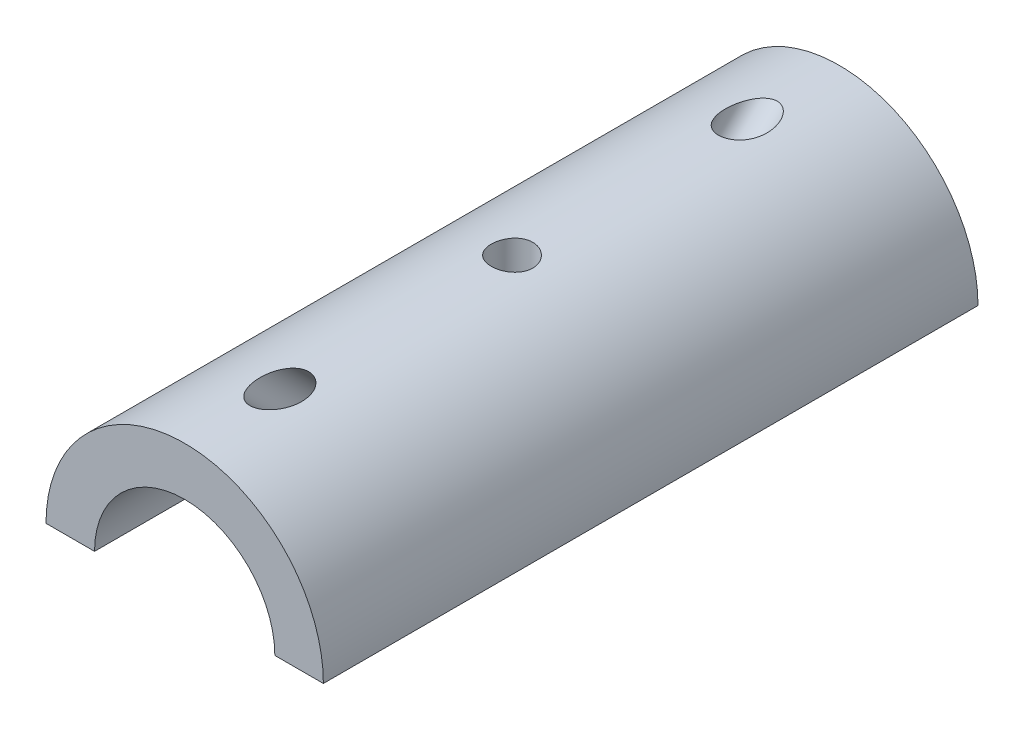
ISO-10303-21;
HEADER;
FILE_DESCRIPTION(('STEP AP214'),'2;1');
FILE_NAME('part.step','',(''),(''),'','','');
FILE_SCHEMA(('AUTOMOTIVE_DESIGN { 1 0 10303 214 1 1 1 1 }'));
ENDSEC;
DATA;
#1=APPLICATION_CONTEXT('core data for automotive mechanical design processes');
#2=APPLICATION_PROTOCOL_DEFINITION('international standard','automotive_design',2000,#1);
#3=PRODUCT_CONTEXT('',#1,'mechanical');
#4=PRODUCT('Part','Part','',(#3));
#5=PRODUCT_RELATED_PRODUCT_CATEGORY('part','',(#4));
#6=PRODUCT_DEFINITION_FORMATION('','',#4);
#7=PRODUCT_DEFINITION_CONTEXT('part definition',#1,'design');
#8=PRODUCT_DEFINITION('design','',#6,#7);
#9=PRODUCT_DEFINITION_SHAPE('','',#8);
#10=(LENGTH_UNIT() NAMED_UNIT(*) SI_UNIT(.MILLI.,.METRE.));
#11=(NAMED_UNIT(*) PLANE_ANGLE_UNIT() SI_UNIT($,.RADIAN.));
#12=(NAMED_UNIT(*) SI_UNIT($,.STERADIAN.) SOLID_ANGLE_UNIT());
#13=UNCERTAINTY_MEASURE_WITH_UNIT(LENGTH_MEASURE(1.E-05),#10,'distance_accuracy_value','');
#14=(GEOMETRIC_REPRESENTATION_CONTEXT(3) GLOBAL_UNCERTAINTY_ASSIGNED_CONTEXT((#13)) GLOBAL_UNIT_ASSIGNED_CONTEXT((#10,
#11,#12)) REPRESENTATION_CONTEXT('',''));
#15=CARTESIAN_POINT('',(0.,0.,0.));
#16=DIRECTION('',(0.,0.,1.));
#17=DIRECTION('',(1.,0.,0.));
#18=AXIS2_PLACEMENT_3D('',#15,#16,#17);
#19=CARTESIAN_POINT('',(0.,0.,47.2));
#20=DIRECTION('',(0.,-1.,0.));
#21=DIRECTION('',(0.,0.,-1.));
#22=AXIS2_PLACEMENT_3D('',#19,#20,#21);
#23=PLANE('',#22);
#24=DIRECTION('',(-1.,0.,0.));
#25=VECTOR('',#24,1.);
#26=CARTESIAN_POINT('',(0.,0.,0.));
#27=LINE('',#26,#25);
#28=CARTESIAN_POINT('',(10.,0.,0.));
#29=VERTEX_POINT('',#28);
#30=CARTESIAN_POINT('',(6.5,0.,0.));
#31=VERTEX_POINT('',#30);
#32=EDGE_CURVE('E118',#29,#31,#27,.T.);
#33=ORIENTED_EDGE('',*,*,#32,.F.);
#34=DIRECTION('',(0.,0.,-1.));
#35=VECTOR('',#34,1.);
#36=CARTESIAN_POINT('',(10.,0.,47.2));
#37=LINE('',#36,#35);
#38=CARTESIAN_POINT('',(10.,0.,47.2));
#39=VERTEX_POINT('',#38);
#40=EDGE_CURVE('E11',#39,#29,#37,.T.);
#41=ORIENTED_EDGE('',*,*,#40,.F.);
#42=DIRECTION('',(-1.,0.,0.));
#43=VECTOR('',#42,1.);
#44=CARTESIAN_POINT('',(0.,0.,47.2));
#45=LINE('',#44,#43);
#46=CARTESIAN_POINT('',(6.5,0.,47.2));
#47=VERTEX_POINT('',#46);
#48=EDGE_CURVE('E98',#39,#47,#45,.T.);
#49=ORIENTED_EDGE('',*,*,#48,.T.);
#50=DIRECTION('',(0.,0.,-1.));
#51=VECTOR('',#50,1.);
#52=CARTESIAN_POINT('',(6.5,0.,47.2));
#53=LINE('',#52,#51);
#54=EDGE_CURVE('E66',#47,#31,#53,.T.);
#55=ORIENTED_EDGE('',*,*,#54,.T.);
#56=EDGE_LOOP('',(#33,#41,#49,#55));
#57=FACE_BOUND('',#56,.T.);
#58=ADVANCED_FACE('F41',(#57),#23,.T.);
#59=CARTESIAN_POINT('',(0.,0.,47.2));
#60=DIRECTION('',(0.,0.,-1.));
#61=DIRECTION('',(-1.,0.,0.));
#62=AXIS2_PLACEMENT_3D('',#59,#60,#61);
#63=CYLINDRICAL_SURFACE('',#62,10.);
#64=CARTESIAN_POINT('',(0.,10.,42.4996946357559));
#65=CARTESIAN_POINT('',(-0.0635989039507117,9.99999967717665,42.4996920436786));
#66=CARTESIAN_POINT('',(-0.127207495527334,9.99938477696123,42.4933020978088));
#67=CARTESIAN_POINT('',(-0.252007458588342,9.99701980142714,42.4684603479657));
#68=CARTESIAN_POINT('',(-0.313196086451994,9.99526847474061,42.4499952473477));
#69=CARTESIAN_POINT('',(-0.430806163939055,9.99088825287487,42.4030100218463));
#70=CARTESIAN_POINT('',(-0.487266234041384,9.98826756493223,42.374583798965));
#71=CARTESIAN_POINT('',(-0.595237629720511,9.98241558292534,42.3096611437978));
#72=CARTESIAN_POINT('',(-0.646746610227039,9.97918400164195,42.2731609140375));
#73=CARTESIAN_POINT('',(-0.770499010242281,9.97055535595661,42.1729182957497));
#74=CARTESIAN_POINT('',(-0.839313474722213,9.96491645458896,42.1049733932648));
#75=CARTESIAN_POINT('',(-0.965496048515054,9.95348364680486,41.959175939002));
#76=CARTESIAN_POINT('',(-1.02283229707522,9.94768935820751,41.8812967656045));
#77=CARTESIAN_POINT('',(-1.15199733435805,9.93372864585401,41.6796816588842));
#78=CARTESIAN_POINT('',(-1.21753240423799,9.92576173913326,41.5519062977958));
#79=CARTESIAN_POINT('',(-1.32782410384219,9.91160603369674,41.2877212459632));
#80=CARTESIAN_POINT('',(-1.37255772370532,9.90541920691462,41.1513021824109));
#81=CARTESIAN_POINT('',(-1.44357544218058,9.89532308685377,40.8686561461704));
#82=CARTESIAN_POINT('',(-1.46916883519212,9.89149985201737,40.7222531561985));
#83=CARTESIAN_POINT('',(-1.49921962458894,9.88699023062867,40.4272655043152));
#84=CARTESIAN_POINT('',(-1.50368292825773,9.88630296736299,40.2786814638078));
#85=CARTESIAN_POINT('',(-1.49060258702766,9.88828311342261,39.9907793502726));
#86=CARTESIAN_POINT('',(-1.47427470408232,9.89076521719285,39.851407442868));
#87=CARTESIAN_POINT('',(-1.41972643907828,9.89874607955285,39.5770354281822));
#88=CARTESIAN_POINT('',(-1.38153161864219,9.90424131558859,39.4420304105095));
#89=CARTESIAN_POINT('',(-1.29385509243652,9.91601351844647,39.2150267529442));
#90=CARTESIAN_POINT('',(-1.2498092575258,9.92172517779647,39.1209030289109));
#91=CARTESIAN_POINT('',(-1.14740716072742,9.9340889184074,38.940834881494));
#92=CARTESIAN_POINT('',(-1.08907228720268,9.94073958787805,38.8548784973973));
#93=CARTESIAN_POINT('',(-0.970931599625774,9.95289179621303,38.711117856903));
#94=CARTESIAN_POINT('',(-0.9137880709378,9.95835501430033,38.6511302854125));
#95=CARTESIAN_POINT('',(-0.790389337606926,9.96890720020389,38.5412392474596));
#96=CARTESIAN_POINT('',(-0.724136500829058,9.97399626475138,38.4913331687206));
#97=CARTESIAN_POINT('',(-0.582960054864975,9.98324549658277,38.4038880140378));
#98=CARTESIAN_POINT('',(-0.507966051527604,9.98739720090838,38.366460261069));
#99=CARTESIAN_POINT('',(-0.351975767201302,9.99410675080151,38.3071889445178));
#100=CARTESIAN_POINT('',(-0.270985934476734,9.99666628160269,38.2853288997554));
#101=CARTESIAN_POINT('',(-0.118279769480278,9.99954866204971,38.2608269253991));
#102=CARTESIAN_POINT('',(-0.0469388411341331,10.0001438139348,38.2558424847074));
#103=CARTESIAN_POINT('',(0.0954617096316786,9.99979732443499,38.2587615395053));
#104=CARTESIAN_POINT('',(0.166521430037876,9.9988562763807,38.2666600591741));
#105=CARTESIAN_POINT('',(0.301456033877372,9.99566838467276,38.2939049543758));
#106=CARTESIAN_POINT('',(0.365495624636665,9.99351179390227,38.3124616173008));
#107=CARTESIAN_POINT('',(0.489784997869023,9.98819221398742,38.3594211533192));
#108=CARTESIAN_POINT('',(0.550034520494336,9.98502915592935,38.3878247006495));
#109=CARTESIAN_POINT('',(0.669030832286039,9.97778357657979,38.4551675462197));
#110=CARTESIAN_POINT('',(0.727475843243674,9.97365760373392,38.4946323954063));
#111=CARTESIAN_POINT('',(0.838009225096328,9.96497967436804,38.5815666770061));
#112=CARTESIAN_POINT('',(0.89009381008862,9.9604274669617,38.6290408371361));
#113=CARTESIAN_POINT('',(1.00822635626238,9.94928933361608,38.7519779747455));
#114=CARTESIAN_POINT('',(1.07081899692213,9.94266022869653,38.8307685224333));
#115=CARTESIAN_POINT('',(1.18236539474259,9.93001347446127,38.9975253472184));
#116=CARTESIAN_POINT('',(1.23129208447275,9.92399705341576,39.0855093665764));
#117=CARTESIAN_POINT('',(1.32984828177012,9.91134442375902,39.2969513816903));
#118=CARTESIAN_POINT('',(1.3746135079915,9.90513431774416,39.4226972892509));
#119=CARTESIAN_POINT('',(1.4435057425282,9.89532536975061,39.6797230678707));
#120=CARTESIAN_POINT('',(1.46760955518643,9.89172946330418,39.8110089854885));
#121=CARTESIAN_POINT('',(1.50080011693299,9.88675820817184,40.1091810011406));
#122=CARTESIAN_POINT('',(1.50454467065039,9.88617483354984,40.2766704448712));
#123=CARTESIAN_POINT('',(1.48493696415328,9.8891380467704,40.6103548616385));
#124=CARTESIAN_POINT('',(1.46152553451969,9.89269365298368,40.7765462107344));
#125=CARTESIAN_POINT('',(1.40628414046452,9.90064041231092,41.0217961692904));
#126=CARTESIAN_POINT('',(1.38437037497752,9.90374501496003,41.1032334726695));
#127=CARTESIAN_POINT('',(1.33357972402698,9.91071302126601,41.2639393289823));
#128=CARTESIAN_POINT('',(1.30470039535891,9.9145766910809,41.3432071100589));
#129=CARTESIAN_POINT('',(1.23981649188422,9.92289879919785,41.498430522161));
#130=CARTESIAN_POINT('',(1.20383701670787,9.92735512481535,41.5743967021809));
#131=CARTESIAN_POINT('',(1.12427948477594,9.93667954991719,41.7221569361075));
#132=CARTESIAN_POINT('',(1.08070938527133,9.9415472154692,41.7939552551308));
#133=CARTESIAN_POINT('',(0.985569274170785,9.95142874377942,41.9316407287742));
#134=CARTESIAN_POINT('',(0.93403420082034,9.95644189387798,41.9975518049831));
#135=CARTESIAN_POINT('',(0.822243321804886,9.96629610262295,42.121553733393));
#136=CARTESIAN_POINT('',(0.761998823108576,9.97113737441191,42.1796545393427));
#137=CARTESIAN_POINT('',(0.644961283169267,9.97931683283171,42.2747241406807));
#138=CARTESIAN_POINT('',(0.589745308913335,9.98276479803552,42.3136072726062));
#139=CARTESIAN_POINT('',(0.473698720935207,9.98894236054643,42.381985177131));
#140=CARTESIAN_POINT('',(0.412874579943458,9.99167277234696,42.4114906023854));
#141=CARTESIAN_POINT('',(0.293970626232979,9.99583392576527,42.4559737007573));
#142=CARTESIAN_POINT('',(0.236380218018727,9.9973780557563,42.4722322710311));
#143=CARTESIAN_POINT('',(0.11919497524955,9.99946085187532,42.4940897944033));
#144=CARTESIAN_POINT('',(0.0596017417082177,10.000000302534,42.4996970649223));
#145=CARTESIAN_POINT('',(0.,10.,42.4996946357559));
#146=B_SPLINE_CURVE_WITH_KNOTS('',3,(#64,#65,#66,#67,#68,#69,#70,#71,#72,#73,#74,#75,#76,#77,
#78,#79,#80,#81,#82,#83,#84,#85,#86,#87,#88,#89,#90,#91,#92,#93,#94,#95,#96,#97,#98,#99,#100,
#101,#102,#103,#104,#105,#106,#107,#108,#109,#110,#111,#112,#113,#114,#115,#116,#117,#118,#119,
#120,#121,#122,#123,#124,#125,#126,#127,#128,#129,#130,#131,#132,#133,#134,#135,#136,#137,#138,
#139,#140,#141,#142,#143,#144,#145),.UNSPECIFIED.,.T.,.F.,(4,2,2,2,2,2,2,2,2,2,2,2,2,2,2,2,2,2,
2,2,2,2,2,2,2,2,2,2,2,2,2,2,2,2,2,2,2,2,2,2,4),(0.,0.190512124971114,0.381234387809704,
0.570205071983639,0.759264825062517,1.04824275186872,1.33801201645226,1.76715501594986,
2.19677159627431,2.64122895645231,3.08556205351433,3.50506683630913,3.92408223225358,
4.23524255199508,4.54593993146281,4.79406458671836,5.04212486619147,5.29234238281923,
5.54229460443784,5.75570246903247,5.96902792804582,6.1682782078554,6.36754213344497,
6.57864081377853,6.78986453972576,7.09073261779101,7.39219245071609,7.79089514401993,
8.19004485919374,8.69017970668593,9.19140633434007,9.44432534483355,9.69733319721725,
9.94946216974217,10.2013284086402,10.4521196536869,10.7025881863443,10.9047270325171,
11.1066354304479,11.2853135390257,11.4638520634256),.UNSPECIFIED.);
#147=CARTESIAN_POINT('',(0.,10.,42.4996946357559));
#148=VERTEX_POINT('',#147);
#149=EDGE_CURVE('E158',#148,#148,#146,.T.);
#150=ORIENTED_EDGE('',*,*,#149,.T.);
#151=EDGE_LOOP('',(#150));
#152=FACE_BOUND('',#151,.T.);
#153=CARTESIAN_POINT('',(0.,10.,8.72132034355961));
#154=CARTESIAN_POINT('',(-0.0705797943787933,9.99999905536321,8.72131574018098));
#155=CARTESIAN_POINT('',(-0.141274718826435,9.99924299381104,8.71497585159836));
#156=CARTESIAN_POINT('',(-0.280513373881056,9.99630888480355,8.68997102586237));
#157=CARTESIAN_POINT('',(-0.349051384974417,9.99412734397485,8.6712758086398));
#158=CARTESIAN_POINT('',(-0.481615941649017,9.98861500679761,8.62274327786498));
#159=CARTESIAN_POINT('',(-0.54566234025768,9.98528970952932,8.59295922299396));
#160=CARTESIAN_POINT('',(-0.668179448887704,9.97784100953055,8.5237523505767));
#161=CARTESIAN_POINT('',(-0.726651611528204,9.97371781558141,8.48433205378537));
#162=CARTESIAN_POINT('',(-0.840756484878766,9.9647687153997,8.39470791260405));
#163=CARTESIAN_POINT('',(-0.895970174886113,9.95991476180265,8.34397661614385));
#164=CARTESIAN_POINT('',(-0.998772038445638,9.95013174611042,8.23533911060014));
#165=CARTESIAN_POINT('',(-1.04635542098707,9.94520263893715,8.17742843378289));
#166=CARTESIAN_POINT('',(-1.15602916547024,9.93317812641462,8.0253497716752));
#167=CARTESIAN_POINT('',(-1.21327844398211,9.92624848197435,7.92766184735301));
#168=CARTESIAN_POINT('',(-1.31130984421856,9.91377303792085,7.72423901912915));
#169=CARTESIAN_POINT('',(-1.35205450750913,9.90823039698178,7.61848645062586));
#170=CARTESIAN_POINT('',(-1.42888639091306,9.89748862478907,7.36772902944473));
#171=CARTESIAN_POINT('',(-1.45933434402231,9.89296402495599,7.22097093227335));
#172=CARTESIAN_POINT('',(-1.49643468436741,9.88741588478573,6.92449967459171));
#173=CARTESIAN_POINT('',(-1.50306535184367,9.88639554013032,6.77478394193126));
#174=CARTESIAN_POINT('',(-1.49429820418548,9.88772420284577,6.47324477086727));
#175=CARTESIAN_POINT('',(-1.47848433505117,9.89013684965283,6.32143455599313));
#176=CARTESIAN_POINT('',(-1.42479774377372,9.89801498842704,6.02181342912102));
#177=CARTESIAN_POINT('',(-1.38692823194614,9.90348003609633,5.87400193836346));
#178=CARTESIAN_POINT('',(-1.29652725335499,9.91568086962093,5.60979570371479));
#179=CARTESIAN_POINT('',(-1.24740694365563,9.92206261696898,5.49221665056421));
#180=CARTESIAN_POINT('',(-1.13198302781147,9.93589556744896,5.26583469216781));
#181=CARTESIAN_POINT('',(-1.06571009482973,9.94334485105456,5.15701657101392));
#182=CARTESIAN_POINT('',(-0.939989592371161,9.95584794903735,4.98836112428636));
#183=CARTESIAN_POINT('',(-0.885950597523688,9.96085032563622,4.92449442330994));
#184=CARTESIAN_POINT('',(-0.768992308600548,9.97056116439287,4.80540393035121));
#185=CARTESIAN_POINT('',(-0.706086819791465,9.97527006735979,4.75016697840448));
#186=CARTESIAN_POINT('',(-0.586972697628632,9.9828923946746,4.66327689109095));
#187=CARTESIAN_POINT('',(-0.532609588148473,9.98596868529521,4.6291266176798));
#188=CARTESIAN_POINT('',(-0.419026687616112,9.99137819600311,4.56999859299364));
#189=CARTESIAN_POINT('',(-0.359810767487723,9.99371200122869,4.54501361633833));
#190=CARTESIAN_POINT('',(-0.237093077763855,9.99737866246551,4.50608234734795));
#191=CARTESIAN_POINT('',(-0.173554512530276,9.99870132327373,4.49224841532619));
#192=CARTESIAN_POINT('',(-0.0449889017829492,10.0001046113332,4.47757736076692));
#193=CARTESIAN_POINT('',(0.0200367198360947,10.000186380687,4.47672828710637));
#194=CARTESIAN_POINT('',(0.13920986717558,9.99918180078329,4.48722334765232));
#195=CARTESIAN_POINT('',(0.193528726969676,9.99826847135846,4.49676134372811));
#196=CARTESIAN_POINT('',(0.299886742259446,9.99564413167844,4.52446257221602));
#197=CARTESIAN_POINT('',(0.35192484042096,9.99393275564918,4.54262975977472));
#198=CARTESIAN_POINT('',(0.467771627419082,9.98926831987482,4.59290931627751));
#199=CARTESIAN_POINT('',(0.530462948554279,9.98609717158818,4.62756464692336));
#200=CARTESIAN_POINT('',(0.649391520028604,9.97907108474966,4.7065124254189));
#201=CARTESIAN_POINT('',(0.705616256223004,9.97521485592538,4.75082309432692));
#202=CARTESIAN_POINT('',(0.834924204638138,9.96537938702517,4.86784746063421));
#203=CARTESIAN_POINT('',(0.904452398724178,9.95921601320522,4.94445130545182));
#204=CARTESIAN_POINT('',(1.03077124510954,9.94693653993095,5.10751103494765));
#205=CARTESIAN_POINT('',(1.08753451798742,9.94082056875588,5.19398750796739));
#206=CARTESIAN_POINT('',(1.17568031233804,9.9307183321041,5.34940421920575));
#207=CARTESIAN_POINT('',(1.20978611741809,9.92660098625179,5.41682287279417));
#208=CARTESIAN_POINT('',(1.27209212001026,9.91880856892926,5.55437485777246));
#209=CARTESIAN_POINT('',(1.30028967852357,9.91513369540573,5.62450938574384));
#210=CARTESIAN_POINT('',(1.37642948722542,9.90495415970392,5.8380422116506));
#211=CARTESIAN_POINT('',(1.41591623186613,9.89929490781751,5.9845649273227));
#212=CARTESIAN_POINT('',(1.47386307737702,9.89083330925307,6.28584734358704));
#213=CARTESIAN_POINT('',(1.49171685327904,9.88811356560998,6.4407227390104));
#214=CARTESIAN_POINT('',(1.50373820151827,9.88629537555802,6.75142007597609));
#215=CARTESIAN_POINT('',(1.49792364566674,9.8871941967875,6.9072412146479));
#216=CARTESIAN_POINT('',(1.4636604586687,9.89231637369963,7.19053383845832));
#217=CARTESIAN_POINT('',(1.43906354302435,9.89597278820505,7.31847908370078));
#218=CARTESIAN_POINT('',(1.3700822169193,9.90576198565284,7.56887993134485));
#219=CARTESIAN_POINT('',(1.32572373397754,9.91189152282468,7.69134249618363));
#220=CARTESIAN_POINT('',(1.22876285501092,9.9243077425904,7.89742429748543));
#221=CARTESIAN_POINT('',(1.18079480163424,9.93019305935935,7.98324300723932));
#222=CARTESIAN_POINT('',(1.07178856116791,9.94254877979915,8.14611017524852));
#223=CARTESIAN_POINT('',(1.01076956276555,9.94901831651365,8.22317125774754));
#224=CARTESIAN_POINT('',(0.888594168223313,9.96059223525419,8.35132929707315));
#225=CARTESIAN_POINT('',(0.829698805419252,9.9657209330372,8.40457282999462));
#226=CARTESIAN_POINT('',(0.703845517832426,9.97539843901633,8.50074216725331));
#227=CARTESIAN_POINT('',(0.636885946320256,9.97994712838168,8.54366585887582));
#228=CARTESIAN_POINT('',(0.49564286885874,9.98796159332431,8.6171348556864));
#229=CARTESIAN_POINT('',(0.421301712075076,9.99141779134632,8.64757134462426));
#230=CARTESIAN_POINT('',(0.268180654191128,9.9966940358463,8.69338798440249));
#231=CARTESIAN_POINT('',(0.189416308570418,9.99851947606553,8.70881778508702));
#232=CARTESIAN_POINT('',(0.0917626313663558,9.99959603656963,8.71791209807733));
#233=CARTESIAN_POINT('',(0.0734359483015065,9.99974720640358,8.71918862166696));
#234=CARTESIAN_POINT('',(0.0367421113203025,9.99994931117351,8.72089334439818));
#235=CARTESIAN_POINT('',(0.0183749573313671,10.0000002459296,8.72132154201714));
#236=CARTESIAN_POINT('',(0.,10.,8.72132034355961));
#237=B_SPLINE_CURVE_WITH_KNOTS('',3,(#153,#154,#155,#156,#157,#158,#159,#160,#161,#162,#163,
#164,#165,#166,#167,#168,#169,#170,#171,#172,#173,#174,#175,#176,#177,#178,#179,#180,#181,#182,
#183,#184,#185,#186,#187,#188,#189,#190,#191,#192,#193,#194,#195,#196,#197,#198,#199,#200,#201,
#202,#203,#204,#205,#206,#207,#208,#209,#210,#211,#212,#213,#214,#215,#216,#217,#218,#219,#220,
#221,#222,#223,#224,#225,#226,#227,#228,#229,#230,#231,#232,#233,#234,#235,#236),.UNSPECIFIED.,
.T.,.F.,(4,2,2,2,2,2,2,2,2,2,2,2,2,2,2,2,2,2,2,2,2,2,2,2,2,2,2,2,2,2,2,2,2,2,2,2,2,2,2,2,2,4),
(0.,0.211659630047636,0.423839922403999,0.635014009528676,0.846132914400965,1.07071825866464,
1.29544407078226,1.63387149948759,1.97306276761053,2.42053708010184,2.86841935556038,
3.32471327303966,3.78094079111613,4.1625482875041,4.5434780337107,4.79421589255306,
5.04456757499099,5.23668909924252,5.42865883904119,5.62253954023662,5.81624178498334,
5.98094935528735,6.14573249143401,6.35965362988408,6.5739820206231,6.88318809976509,
7.19305119869092,7.41976131748973,7.64657248459537,8.10021114755816,8.56629026548434,
9.03201751525432,9.42168173080007,9.8108361989376,10.1052728203402,10.3992794741547,
10.6370211651337,10.8748114860743,11.114632070921,11.3536564791173,11.4087604890466,
11.4638645978801),.UNSPECIFIED.);
#238=CARTESIAN_POINT('',(0.,10.,8.72132034355961));
#239=VERTEX_POINT('',#238);
#240=EDGE_CURVE('E130',#239,#239,#237,.T.);
#241=ORIENTED_EDGE('',*,*,#240,.T.);
#242=EDGE_LOOP('',(#241));
#243=FACE_BOUND('',#242,.T.);
#244=CARTESIAN_POINT('',(0.,10.,25.1));
#245=CARTESIAN_POINT('',(-0.0837515444816421,9.99999865771297,25.0999965461848));
#246=CARTESIAN_POINT('',(-0.167551685082132,9.9989368253704,25.0929619991594));
#247=CARTESIAN_POINT('',(-0.332809627994913,9.99480315973187,25.0650168000173));
#248=CARTESIAN_POINT('',(-0.41426506897423,9.99172936938473,25.0440926370551));
#249=CARTESIAN_POINT('',(-0.57241808622186,9.98391721219525,24.9890074950324));
#250=CARTESIAN_POINT('',(-0.649119207826797,9.97918010370919,24.9548565204941));
#251=CARTESIAN_POINT('',(-0.795690428635252,9.96856475911724,24.8743116205831));
#252=CARTESIAN_POINT('',(-0.865561474725188,9.96268668152773,24.8279193955826));
#253=CARTESIAN_POINT('',(-0.997046719562125,9.95039170991452,24.7238227350601));
#254=CARTESIAN_POINT('',(-1.0585998322255,9.94397133890331,24.6660415437918));
#255=CARTESIAN_POINT('',(-1.17117490668948,9.93134261133238,24.5409723111061));
#256=CARTESIAN_POINT('',(-1.22219626272936,9.92513426698505,24.4736837232215));
#257=CARTESIAN_POINT('',(-1.31249729499943,9.91359877458726,24.3310993564775));
#258=CARTESIAN_POINT('',(-1.35171787037205,9.90827611975031,24.2557657530187));
#259=CARTESIAN_POINT('',(-1.41692632171056,9.89916211306268,24.0994871793546));
#260=CARTESIAN_POINT('',(-1.44291491889163,9.89537067775449,24.0185425152561));
#261=CARTESIAN_POINT('',(-1.48073198798911,9.88978256218673,23.8539819581283));
#262=CARTESIAN_POINT('',(-1.49266503640517,9.8879711574125,23.770390606592));
#263=CARTESIAN_POINT('',(-1.50235624033932,9.88650348970582,23.6023738340127));
#264=CARTESIAN_POINT('',(-1.50011520973796,9.88684710303147,23.5179484611375));
#265=CARTESIAN_POINT('',(-1.48160733250787,9.88963718352409,23.3513989198059));
#266=CARTESIAN_POINT('',(-1.4654569592775,9.89206618761549,23.2692614735152));
#267=CARTESIAN_POINT('',(-1.41977117403734,9.89872608126367,23.1088756311285));
#268=CARTESIAN_POINT('',(-1.39023538337812,9.90295702179379,23.0306273451193));
#269=CARTESIAN_POINT('',(-1.31849603529736,9.91276335545481,22.8798866287171));
#270=CARTESIAN_POINT('',(-1.27624314283197,9.91834396766526,22.8074180309076));
#271=CARTESIAN_POINT('',(-1.18030413128955,9.93021707574548,22.6705554042181));
#272=CARTESIAN_POINT('',(-1.12661726182478,9.93650961832501,22.6061619057306));
#273=CARTESIAN_POINT('',(-1.00869493078248,9.94917473056209,22.4866023392603));
#274=CARTESIAN_POINT('',(-0.944359329641999,9.95554747112815,22.4315350097137));
#275=CARTESIAN_POINT('',(-0.807307089894183,9.96759647648462,22.3329640654927));
#276=CARTESIAN_POINT('',(-0.734590414588167,9.9732727382251,22.2894605014561));
#277=CARTESIAN_POINT('',(-0.582754598213681,9.98329515585393,22.2152469135005));
#278=CARTESIAN_POINT('',(-0.503631677836775,9.98764051925428,22.1845445081597));
#279=CARTESIAN_POINT('',(-0.341273182487055,9.99450490557069,22.1368906103146));
#280=CARTESIAN_POINT('',(-0.258037885952594,9.99702405195467,22.1199381881844));
#281=CARTESIAN_POINT('',(-0.09066956764364,9.99993581133871,22.1003967701833));
#282=CARTESIAN_POINT('',(-0.00655273187046385,10.0003485209039,22.0976720286207));
#283=CARTESIAN_POINT('',(0.160936677662289,9.99905561015226,22.106303005311));
#284=CARTESIAN_POINT('',(0.244309274381883,9.99735005541368,22.1176582876681));
#285=CARTESIAN_POINT('',(0.407532387431414,9.99202468615333,22.1540141001775));
#286=CARTESIAN_POINT('',(0.487397963079844,9.98841415207984,22.1789484960308));
#287=CARTESIAN_POINT('',(0.641814958643006,9.97968235658369,22.2416849974618));
#288=CARTESIAN_POINT('',(0.716366128795106,9.97456102421565,22.2794877073336));
#289=CARTESIAN_POINT('',(0.858634979291928,9.96332682468686,22.3672062245639));
#290=CARTESIAN_POINT('',(0.926299009891573,9.95720701626745,22.4172081400128));
#291=CARTESIAN_POINT('',(1.05232367317771,9.94467863012165,22.5277858116288));
#292=CARTESIAN_POINT('',(1.11068376479341,9.93827003562867,22.5883621823247));
#293=CARTESIAN_POINT('',(1.21693784957196,9.92582264304494,22.7189735331765));
#294=CARTESIAN_POINT('',(1.26474084747422,9.91978736017588,22.7890829251948));
#295=CARTESIAN_POINT('',(1.34789129270585,9.90883219104903,22.9364160405118));
#296=CARTESIAN_POINT('',(1.38323907656436,9.90391227465628,23.0136395715215));
#297=CARTESIAN_POINT('',(1.44033467323944,9.89577033008645,23.1727375336231));
#298=CARTESIAN_POINT('',(1.46213037141636,9.89254233006438,23.2545944609712));
#299=CARTESIAN_POINT('',(1.49165549501587,9.88813382297802,23.4208590154351));
#300=CARTESIAN_POINT('',(1.49938589183067,9.88695317451771,23.5052664659947));
#301=CARTESIAN_POINT('',(1.5005378666944,9.88677832610841,23.6733290633158));
#302=CARTESIAN_POINT('',(1.49410252167313,9.88776226333502,23.7569832417569));
#303=CARTESIAN_POINT('',(1.46741229544379,9.89175820611174,23.9220052633235));
#304=CARTESIAN_POINT('',(1.44715743638627,9.89477020841117,24.0033731101134));
#305=CARTESIAN_POINT('',(1.39345373518665,9.90247526112297,24.1614730822343));
#306=CARTESIAN_POINT('',(1.36001489324314,9.90716703716075,24.2382086704334));
#307=CARTESIAN_POINT('',(1.28090667642309,9.91770454557702,24.3850036338024));
#308=CARTESIAN_POINT('',(1.23523688741502,9.92355031702724,24.4550627828037));
#309=CARTESIAN_POINT('',(1.13244337659164,9.93580743364938,24.5872430579752));
#310=CARTESIAN_POINT('',(1.07521369039806,9.94222367881967,24.6492813332471));
#311=CARTESIAN_POINT('',(0.951148841082837,9.95485788826636,24.7629245547878));
#312=CARTESIAN_POINT('',(0.884311448350943,9.96107580610759,24.8145270725762));
#313=CARTESIAN_POINT('',(0.742495707543723,9.9726518579052,24.9060876766074));
#314=CARTESIAN_POINT('',(0.667474576764761,9.9780050712882,24.9459801092148));
#315=CARTESIAN_POINT('',(0.51175187024872,9.98720028802959,25.012538516758));
#316=CARTESIAN_POINT('',(0.431056277096705,9.99104385565757,25.0392181900537));
#317=CARTESIAN_POINT('',(0.291665727889329,9.99590939261505,25.0725413427101));
#318=CARTESIAN_POINT('',(0.233831133495278,9.99743549179557,25.0828226015388));
#319=CARTESIAN_POINT('',(0.117338971600125,9.99948125947895,25.0965530977126));
#320=CARTESIAN_POINT('',(0.0586814143344171,10.0000009404877,25.1000024199525));
#321=CARTESIAN_POINT('',(0.,10.,25.1));
#322=B_SPLINE_CURVE_WITH_KNOTS('',3,(#244,#245,#246,#247,#248,#249,#250,#251,#252,#253,#254,
#255,#256,#257,#258,#259,#260,#261,#262,#263,#264,#265,#266,#267,#268,#269,#270,#271,#272,#273,
#274,#275,#276,#277,#278,#279,#280,#281,#282,#283,#284,#285,#286,#287,#288,#289,#290,#291,#292,
#293,#294,#295,#296,#297,#298,#299,#300,#301,#302,#303,#304,#305,#306,#307,#308,#309,#310,#311,
#312,#313,#314,#315,#316,#317,#318,#319,#320,#321),.UNSPECIFIED.,.T.,.F.,(4,2,2,2,2,2,2,2,2,2,2,
2,2,2,2,2,2,2,2,2,2,2,2,2,2,2,2,2,2,2,2,2,2,2,2,2,2,2,4),(0.,0.251040205031663,
0.502324962929151,0.753420023583236,1.0044802241976,1.25729416136843,1.5101226357258,
1.76419702395375,2.01825756225506,2.27041564605925,2.52255925098983,2.77261177195747,
3.02267136690361,3.27371383476159,3.52477278308534,3.77834291255408,4.03191415238668,
4.28563608984875,4.53934087193401,4.79062058544255,5.04189251991155,5.29195148965948,
5.54202220376274,5.79391188036908,6.0458162002863,6.29981366584672,6.55380426808832,
6.80689223457168,7.05996272137177,7.31048888261065,7.56101464229564,7.81135073984147,
8.0616953146688,8.31444829965721,8.56726003468733,8.82146323384734,9.07540233261442,
9.25129851978808,9.42719252123291),.UNSPECIFIED.);
#323=CARTESIAN_POINT('',(0.,10.,25.1));
#324=VERTEX_POINT('',#323);
#325=EDGE_CURVE('E129',#324,#324,#322,.T.);
#326=ORIENTED_EDGE('',*,*,#325,.T.);
#327=EDGE_LOOP('',(#326));
#328=FACE_BOUND('',#327,.T.);
#329=CARTESIAN_POINT('',(0.,0.,0.));
#330=DIRECTION('',(0.,0.,1.));
#331=DIRECTION('',(1.,0.,0.));
#332=AXIS2_PLACEMENT_3D('',#329,#330,#331);
#333=CIRCLE('',#332,10.);
#334=CARTESIAN_POINT('',(-10.,0.,0.));
#335=VERTEX_POINT('',#334);
#336=EDGE_CURVE('E103',#29,#335,#333,.T.);
#337=ORIENTED_EDGE('',*,*,#336,.T.);
#338=DIRECTION('',(0.,0.,-1.));
#339=VECTOR('',#338,1.);
#340=CARTESIAN_POINT('',(-10.,0.,47.2));
#341=LINE('',#340,#339);
#342=CARTESIAN_POINT('',(-10.,0.,47.2));
#343=VERTEX_POINT('',#342);
#344=EDGE_CURVE('E57',#343,#335,#341,.T.);
#345=ORIENTED_EDGE('',*,*,#344,.F.);
#346=CARTESIAN_POINT('',(0.,0.,47.2));
#347=DIRECTION('',(0.,0.,1.));
#348=DIRECTION('',(1.,0.,0.));
#349=AXIS2_PLACEMENT_3D('',#346,#347,#348);
#350=CIRCLE('',#349,10.);
#351=EDGE_CURVE('E92',#39,#343,#350,.T.);
#352=ORIENTED_EDGE('',*,*,#351,.F.);
#353=ORIENTED_EDGE('',*,*,#40,.T.);
#354=EDGE_LOOP('',(#337,#345,#352,#353));
#355=FACE_BOUND('',#354,.T.);
#356=ADVANCED_FACE('F43',(#152,#243,#328,#355),#63,.T.);
#357=CARTESIAN_POINT('',(-6.5,0.,0.));
#358=VERTEX_POINT('',#357);
#359=EDGE_CURVE('E114',#358,#335,#27,.T.);
#360=ORIENTED_EDGE('',*,*,#359,.F.);
#361=DIRECTION('',(0.,0.,-1.));
#362=VECTOR('',#361,1.);
#363=CARTESIAN_POINT('',(-6.5,0.,47.2));
#364=LINE('',#363,#362);
#365=CARTESIAN_POINT('',(-6.5,0.,47.2));
#366=VERTEX_POINT('',#365);
#367=EDGE_CURVE('E79',#366,#358,#364,.T.);
#368=ORIENTED_EDGE('',*,*,#367,.F.);
#369=EDGE_CURVE('E97',#366,#343,#45,.T.);
#370=ORIENTED_EDGE('',*,*,#369,.T.);
#371=ORIENTED_EDGE('',*,*,#344,.T.);
#372=EDGE_LOOP('',(#360,#368,#370,#371));
#373=FACE_BOUND('',#372,.T.);
#374=ADVANCED_FACE('F107',(#373),#23,.T.);
#375=CARTESIAN_POINT('',(0.,0.,47.2));
#376=DIRECTION('',(0.,0.,-1.));
#377=DIRECTION('',(-1.,0.,0.));
#378=AXIS2_PLACEMENT_3D('',#375,#376,#377);
#379=CYLINDRICAL_SURFACE('',#378,6.5);
#380=CARTESIAN_POINT('',(0.,6.5,38.9996946357559));
#381=CARTESIAN_POINT('',(-0.0619092465410302,6.49999792734435,38.9996825581342));
#382=CARTESIAN_POINT('',(-0.123917166981275,6.49910052638467,38.9933036349979));
#383=CARTESIAN_POINT('',(-0.245491549675519,6.49564985171595,38.9685486024746));
#384=CARTESIAN_POINT('',(-0.305050918219491,6.49309208412782,38.950139932972));
#385=CARTESIAN_POINT('',(-0.419266804665361,6.48671392681813,38.9035408858524));
#386=CARTESIAN_POINT('',(-0.473970795599883,6.48290801123428,38.8754624646377));
#387=CARTESIAN_POINT('',(-0.578506328113852,6.47441779001705,38.8115936505839));
#388=CARTESIAN_POINT('',(-0.628336810744602,6.46973329412213,38.7758015870613));
#389=CARTESIAN_POINT('',(-0.750935689331134,6.45692159095192,38.6755158741177));
#390=CARTESIAN_POINT('',(-0.819963488857144,6.4483896767112,38.606520395327));
#391=CARTESIAN_POINT('',(-0.946589500049811,6.43102376493967,38.4587204165036));
#392=CARTESIAN_POINT('',(-1.004152837401,6.42218893870252,38.3798871386853));
#393=CARTESIAN_POINT('',(-1.09685016882001,6.40691636778288,38.2345239974874));
#394=CARTESIAN_POINT('',(-1.13409908823886,6.40039412955694,38.1693270481213));
#395=CARTESIAN_POINT('',(-1.20287595194254,6.38782496696989,38.0359216938549));
#396=CARTESIAN_POINT('',(-1.23440084945134,6.38177829670848,37.9677117090538));
#397=CARTESIAN_POINT('',(-1.32090250538673,6.36464619888048,37.7595613406484));
#398=CARTESIAN_POINT('',(-1.36779573638236,6.35457055329941,37.6161176826824));
#399=CARTESIAN_POINT('',(-1.44240404129436,6.33805633122259,37.3183791822296));
#400=CARTESIAN_POINT('',(-1.46931600560292,6.33177179541426,37.1638791542483));
#401=CARTESIAN_POINT('',(-1.5001965912958,6.32453078019319,36.8524877970209));
#402=CARTESIAN_POINT('',(-1.50418627804559,6.32356940886998,36.6955987962349));
#403=CARTESIAN_POINT('',(-1.48825866655575,6.32733113563806,36.4099202818097));
#404=CARTESIAN_POINT('',(-1.47230274926049,6.33111268886507,36.2809019842923));
#405=CARTESIAN_POINT('',(-1.42072359954912,6.34289214263285,36.0269991566227));
#406=CARTESIAN_POINT('',(-1.38512659252303,6.35088442024316,35.902109349158));
#407=CARTESIAN_POINT('',(-1.3027005356733,6.36822425483956,35.6889895359247));
#408=CARTESIAN_POINT('',(-1.26037678291268,6.37683022293506,35.598963893155));
#409=CARTESIAN_POINT('',(-1.16184488739103,6.39551655398468,35.4269965381506));
#410=CARTESIAN_POINT('',(-1.10565456149281,6.40559501823339,35.3450446397336));
#411=CARTESIAN_POINT('',(-0.990158253419001,6.42435812036687,35.2059370443036));
#412=CARTESIAN_POINT('',(-0.933063577041656,6.43298312545401,35.1469428688211));
#413=CARTESIAN_POINT('',(-0.809778516027021,6.44966029295496,35.0391893857023));
#414=CARTESIAN_POINT('',(-0.743590679866351,6.4577126149144,34.9904272200552));
#415=CARTESIAN_POINT('',(-0.60296932914074,6.47235993602141,34.9051470658052));
#416=CARTESIAN_POINT('',(-0.528487156447621,6.47894557362752,34.8687070025611));
#417=CARTESIAN_POINT('',(-0.373816220296043,6.48970310915441,34.8104948589449));
#418=CARTESIAN_POINT('',(-0.293630549901069,6.49387630432627,34.7887148943093));
#419=CARTESIAN_POINT('',(-0.139599817969235,6.49890598993744,34.7626273555906));
#420=CARTESIAN_POINT('',(-0.0660462565847398,6.50008073903748,34.7566406482251));
#421=CARTESIAN_POINT('',(0.0809677575242379,6.49991069765969,34.7575111644615));
#422=CARTESIAN_POINT('',(0.154428234286752,6.4985668172994,34.7643637485303));
#423=CARTESIAN_POINT('',(0.29564682480783,6.49364017444777,34.789965923567));
#424=CARTESIAN_POINT('',(0.36351184210057,6.49016316074614,34.8081541945929));
#425=CARTESIAN_POINT('',(0.495329285199243,6.4814362749506,34.8551250884979));
#426=CARTESIAN_POINT('',(0.559281557432734,6.4761863333232,34.8839081269033));
#427=CARTESIAN_POINT('',(0.684125098934937,6.46421340855097,34.9521662247381));
#428=CARTESIAN_POINT('',(0.744816982287933,6.45744330837893,34.9919959195789));
#429=CARTESIAN_POINT('',(0.859418630032978,6.44319342430839,35.0803013638794));
#430=CARTESIAN_POINT('',(0.913326271105701,6.4357134195038,35.1287798087883));
#431=CARTESIAN_POINT('',(1.01937317750787,6.41981871477926,35.2385892492657));
#432=CARTESIAN_POINT('',(1.07064849008617,6.41139260834712,35.3007500990441));
#433=CARTESIAN_POINT('',(1.16392319837185,6.39511703974242,35.4317169428283));
#434=CARTESIAN_POINT('',(1.20591641271559,6.38726796414824,35.5005273214858));
#435=CARTESIAN_POINT('',(1.29916513832294,6.36910081624437,35.677795294699));
#436=CARTESIAN_POINT('',(1.34494271853316,6.35944667464547,35.7892161197868));
#437=CARTESIAN_POINT('',(1.41819127877021,6.34350929577447,36.0181624095367));
#438=CARTESIAN_POINT('',(1.44562290743641,6.33723331010446,36.135700417399));
#439=CARTESIAN_POINT('',(1.49025593334203,6.3269160872716,36.4117625192053));
#440=CARTESIAN_POINT('',(1.50133576540695,6.32424138073678,36.5713181823024));
#441=CARTESIAN_POINT('',(1.49840587666451,6.32493052757279,36.8902828916912));
#442=CARTESIAN_POINT('',(1.48435594756332,6.32830405830645,37.0496912939747));
#443=CARTESIAN_POINT('',(1.44561237170301,6.33722011988738,37.2871548156082));
#444=CARTESIAN_POINT('',(1.42951245174929,6.34088875315861,37.3667840018487));
#445=CARTESIAN_POINT('',(1.39130740776127,6.34938213901912,37.5245175240352));
#446=CARTESIAN_POINT('',(1.36920439493532,6.35420648508928,37.6026223857348));
#447=CARTESIAN_POINT('',(1.31894925510935,6.36482767460983,37.7566836301369));
#448=CARTESIAN_POINT('',(1.29080515130443,6.37062322598159,37.8326427126949));
#449=CARTESIAN_POINT('',(1.22822854193278,6.38298290160051,37.9818253882792));
#450=CARTESIAN_POINT('',(1.19379929967392,6.38954662637241,38.0550503772195));
#451=CARTESIAN_POINT('',(1.10976744979555,6.40473566400448,38.2139799136195));
#452=CARTESIAN_POINT('',(1.05849357259411,6.4134932850697,38.2988023694994));
#453=CARTESIAN_POINT('',(0.944859466463487,6.43121677902593,38.4606862425104));
#454=CARTESIAN_POINT('',(0.882513620837598,6.4401823687688,38.5377575279322));
#455=CARTESIAN_POINT('',(0.763360073196067,6.45522106543759,38.6616621743728));
#456=CARTESIAN_POINT('',(0.709342988602139,6.46143909196339,38.7111415177701));
#457=CARTESIAN_POINT('',(0.594232181270154,6.47303777549174,38.8012596247015));
#458=CARTESIAN_POINT('',(0.533148963250745,6.47841964833078,38.8419112593443));
#459=CARTESIAN_POINT('',(0.419954162806017,6.48660403793193,38.9027611675723));
#460=CARTESIAN_POINT('',(0.36925304994611,6.48971556927672,38.9255285938071));
#461=CARTESIAN_POINT('',(0.264816807554287,6.49481197437235,38.9625428053593));
#462=CARTESIAN_POINT('',(0.21108961896034,6.49679965850312,38.9768108497279));
#463=CARTESIAN_POINT('',(0.130718620504245,6.49873724803283,38.9906828587323));
#464=CARTESIAN_POINT('',(0.104699658674553,6.49920907019936,38.9940524365951));
#465=CARTESIAN_POINT('',(0.0524597436722873,6.49984093060273,38.998561207835));
#466=CARTESIAN_POINT('',(0.0262387341477478,6.50000087844488,38.9996997545631));
#467=CARTESIAN_POINT('',(0.,6.5,38.9996946357559));
#468=B_SPLINE_CURVE_WITH_KNOTS('',3,(#380,#381,#382,#383,#384,#385,#386,#387,#388,#389,#390,
#391,#392,#393,#394,#395,#396,#397,#398,#399,#400,#401,#402,#403,#404,#405,#406,#407,#408,#409,
#410,#411,#412,#413,#414,#415,#416,#417,#418,#419,#420,#421,#422,#423,#424,#425,#426,#427,#428,
#429,#430,#431,#432,#433,#434,#435,#436,#437,#438,#439,#440,#441,#442,#443,#444,#445,#446,#447,
#448,#449,#450,#451,#452,#453,#454,#455,#456,#457,#458,#459,#460,#461,#462,#463,#464,#465,#466,
#467),.UNSPECIFIED.,.T.,.F.,(4,2,2,2,2,2,2,2,2,2,2,2,2,2,2,2,2,2,2,2,2,2,2,2,2,2,2,2,2,2,2,2,2,
2,2,2,2,2,2,2,2,2,2,4),(0.,0.185590238956938,0.37168489492877,0.555693609696634,
0.73974221869888,1.03200882458131,1.32515134934391,1.55096394232612,1.77689638046659,
2.2288211013172,2.69805054921678,3.16684871044316,3.55569139324064,3.94401613330554,
4.24248075630546,4.54056386716681,4.78720324865154,5.03377364671212,5.28187541101155,
5.52984363828574,5.75012928333915,5.97033534257999,6.18041970046263,6.39051229872329,
6.60833993589841,6.8262355796993,7.06837258346333,7.31067035447845,7.6711903403423,
8.03248116856051,8.50989005872816,8.98806349942152,9.23183565203029,9.47552218396248,
9.71888705557368,9.96212592720299,10.2598906793783,10.5572714056718,10.777156875499,
10.9967195593602,11.1631019586361,11.329066427749,11.4077015653813,11.4863594914987),.UNSPECIFIED.);
#469=CARTESIAN_POINT('',(0.,6.5,38.9996946357559));
#470=VERTEX_POINT('',#469);
#471=EDGE_CURVE('E46',#470,#470,#468,.T.);
#472=ORIENTED_EDGE('',*,*,#471,.F.);
#473=EDGE_LOOP('',(#472));
#474=FACE_BOUND('',#473,.T.);
#475=CARTESIAN_POINT('',(0.,6.5,12.2213203435595));
#476=CARTESIAN_POINT('',(-0.0728674052216488,6.49999823261963,12.2213159749288));
#477=CARTESIAN_POINT('',(-0.145790493777655,6.49876070420688,12.2150042693145));
#478=CARTESIAN_POINT('',(-0.289458361163802,6.49395104045953,12.1900353990725));
#479=CARTESIAN_POINT('',(-0.360200395326192,6.49037607993732,12.1713632944423));
#480=CARTESIAN_POINT('',(-0.497239209697354,6.48131607429737,12.122604983462));
#481=CARTESIAN_POINT('',(-0.563548863082662,6.47583687531032,12.0925536869413));
#482=CARTESIAN_POINT('',(-0.690378222631561,6.46354745560567,12.022323743644));
#483=CARTESIAN_POINT('',(-0.750898382860021,6.45673733939843,11.9821458919841));
#484=CARTESIAN_POINT('',(-0.867749162341334,6.44209934560419,11.8911288251651));
#485=CARTESIAN_POINT('',(-0.923757469575655,6.43423899998121,11.8398831117643));
#486=CARTESIAN_POINT('',(-1.02768406721095,6.41846016921053,11.7298006689165));
#487=CARTESIAN_POINT('',(-1.0755982461272,6.41054165663463,11.6709601082081));
#488=CARTESIAN_POINT('',(-1.18136001950017,6.39205561235568,11.5217527760992));
#489=CARTESIAN_POINT('',(-1.23509382876442,6.38175041751585,11.4284272451703));
#490=CARTESIAN_POINT('',(-1.32678821730255,6.36331766151884,11.2341099417166));
#491=CARTESIAN_POINT('',(-1.36471635968371,6.35519459060114,11.1331029020956));
#492=CARTESIAN_POINT('',(-1.43606455662432,6.33951908885966,10.8929533194321));
#493=CARTESIAN_POINT('',(-1.46398252013016,6.33301629589136,10.7521147466414));
#494=CARTESIAN_POINT('',(-1.49745374418492,6.32517848701073,10.4677690837806));
#495=CARTESIAN_POINT('',(-1.50298445169609,6.32384868244625,10.3242594489615));
#496=CARTESIAN_POINT('',(-1.49396532126352,6.32598498875939,10.0346091949842));
#497=CARTESIAN_POINT('',(-1.4789431169612,6.32956392160076,9.8884854812038));
#498=CARTESIAN_POINT('',(-1.42930594906965,6.34095648472005,9.59975698346748));
#499=CARTESIAN_POINT('',(-1.39468359365114,6.34877171258989,9.45715354830551));
#500=CARTESIAN_POINT('',(-1.30828559012258,6.36712234948754,9.18630506529159));
#501=CARTESIAN_POINT('',(-1.25760726858455,6.37747610105236,9.05770556257299));
#502=CARTESIAN_POINT('',(-1.167501074237,6.39436110471784,8.87191163317113));
#503=CARTESIAN_POINT('',(-1.13513357995146,6.40021251419834,8.81118779562504));
#504=CARTESIAN_POINT('',(-1.06537657500524,6.41219378030786,8.6927432884254));
#505=CARTESIAN_POINT('',(-1.02798991629219,6.41832347751102,8.63502093894413));
#506=CARTESIAN_POINT('',(-0.939757451362161,6.43189204410763,8.51223760026419));
#507=CARTESIAN_POINT('',(-0.8877159274593,6.43934707094926,8.44802451366988));
#508=CARTESIAN_POINT('',(-0.77510946591344,6.45386865452129,8.32746771938445));
#509=CARTESIAN_POINT('',(-0.714555932903362,6.46093571372681,8.27111367994985));
#510=CARTESIAN_POINT('',(-0.599479960406167,6.47249154197603,8.18138292377484));
#511=CARTESIAN_POINT('',(-0.546790441634682,6.47719894981551,8.14570484610052));
#512=CARTESIAN_POINT('',(-0.436319954259168,6.48557444155999,8.08315701053076));
#513=CARTESIAN_POINT('',(-0.378546831807362,6.48924409151448,8.05627397058302));
#514=CARTESIAN_POINT('',(-0.269230522349659,6.49461092812162,8.01728837294379));
#515=CARTESIAN_POINT('',(-0.218327209924608,6.49653893315443,8.00343796371152));
#516=CARTESIAN_POINT('',(-0.114889413170336,6.49918985344037,7.98444458359012));
#517=CARTESIAN_POINT('',(-0.0623561423671704,6.49991364431075,7.97929528584074));
#518=CARTESIAN_POINT('',(0.0428894621649479,6.50007178078398,7.97816792154861));
#519=CARTESIAN_POINT('',(0.0956019450778782,6.49950425546235,7.98220316203401));
#520=CARTESIAN_POINT('',(0.199564569313691,6.49714441795924,7.99909256619673));
#521=CARTESIAN_POINT('',(0.250813698104725,6.49535127816053,8.01195268905086));
#522=CARTESIAN_POINT('',(0.361259304155166,6.4902361189062,8.04903143931443));
#523=CARTESIAN_POINT('',(0.419823459538246,6.48666980184893,8.07508597108719));
#524=CARTESIAN_POINT('',(0.531877938610033,6.47844741731011,8.13629969839969));
#525=CARTESIAN_POINT('',(0.585359459451115,6.47378950590755,8.17147431039141));
#526=CARTESIAN_POINT('',(0.709713767583626,6.46156191798023,8.26605517270087));
#527=CARTESIAN_POINT('',(0.777642162468947,6.45362270341673,8.32925710005366));
#528=CARTESIAN_POINT('',(0.902899038636924,6.43729585666482,8.46534532963206));
#529=CARTESIAN_POINT('',(0.960202405573905,6.42890722096435,8.53825389442193));
#530=CARTESIAN_POINT('',(1.05345323322248,6.41419745567171,8.67366229668456));
#531=CARTESIAN_POINT('',(1.0913145916612,6.40783196351935,8.73486378374588));
#532=CARTESIAN_POINT('',(1.16163775201539,6.39545690052003,8.86034570589795));
#533=CARTESIAN_POINT('',(1.19409660302459,6.38944752533428,8.92462779912191));
#534=CARTESIAN_POINT('',(1.28389799971379,6.37223405989929,9.12109760178851));
#535=CARTESIAN_POINT('',(1.33364569640176,6.36184798661774,9.25687899273709));
#536=CARTESIAN_POINT('',(1.41589923375514,6.34405629886296,9.54014767448896));
#537=CARTESIAN_POINT('',(1.44754912560523,6.33680211136123,9.68788714064216));
#538=CARTESIAN_POINT('',(1.48990111970197,6.32698034264538,9.98648810959992));
#539=CARTESIAN_POINT('',(1.50061427746749,6.32441028805087,10.137347922169));
#540=CARTESIAN_POINT('',(1.49939067968817,6.32469923727424,10.4251185949452));
#541=CARTESIAN_POINT('',(1.48944929006553,6.32707998137568,10.5620343768493));
#542=CARTESIAN_POINT('',(1.4485227160051,6.33658143177196,10.8325821982285));
#543=CARTESIAN_POINT('',(1.41756421095457,6.34369612850108,10.9662181785471));
#544=CARTESIAN_POINT('',(1.3423858035424,6.35995747324708,11.1934811177122));
#545=CARTESIAN_POINT('',(1.30329880000266,6.36817426935247,11.2888657903526));
#546=CARTESIAN_POINT('',(1.21048172302283,6.38646831616192,11.4720509738133));
#547=CARTESIAN_POINT('',(1.15677257577517,6.39654290152953,11.5598620886829));
#548=CARTESIAN_POINT('',(1.04532032289554,6.41559668062008,11.7093342436256));
#549=CARTESIAN_POINT('',(0.990056149762342,6.4244452574184,11.7728542399634));
#550=CARTESIAN_POINT('',(0.869676817022613,6.44184376828691,11.8899386774288));
#551=CARTESIAN_POINT('',(0.804561464800019,6.45039369651372,11.94350292385));
#552=CARTESIAN_POINT('',(0.665097021334867,6.46626624604905,12.0385137326429));
#553=CARTESIAN_POINT('',(0.590682364175931,6.4735791856258,12.0798664375576));
#554=CARTESIAN_POINT('',(0.435197185244648,6.48587957389928,12.1475460764601));
#555=CARTESIAN_POINT('',(0.354141036665926,6.49087189617125,12.1739045264946));
#556=CARTESIAN_POINT('',(0.226799209145885,6.49619641199173,12.201719081527));
#557=CARTESIAN_POINT('',(0.181772497180139,6.49761602811527,12.2090543083526));
#558=CARTESIAN_POINT('',(0.0911710973813111,6.4995183404587,12.2188561262634));
#559=CARTESIAN_POINT('',(0.0455964503020317,6.50000110593029,12.2213230772105));
#560=CARTESIAN_POINT('',(0.,6.5,12.2213203435595));
#561=B_SPLINE_CURVE_WITH_KNOTS('',3,(#475,#476,#477,#478,#479,#480,#481,#482,#483,#484,#485,
#486,#487,#488,#489,#490,#491,#492,#493,#494,#495,#496,#497,#498,#499,#500,#501,#502,#503,#504,
#505,#506,#507,#508,#509,#510,#511,#512,#513,#514,#515,#516,#517,#518,#519,#520,#521,#522,#523,
#524,#525,#526,#527,#528,#529,#530,#531,#532,#533,#534,#535,#536,#537,#538,#539,#540,#541,#542,
#543,#544,#545,#546,#547,#548,#549,#550,#551,#552,#553,#554,#555,#556,#557,#558,#559,#560),
.UNSPECIFIED.,.T.,.F.,(4,2,2,2,2,2,2,2,2,2,2,2,2,2,2,2,2,2,2,2,2,2,2,2,2,2,2,2,2,2,2,2,2,2,2,2,
2,2,2,2,2,2,4),(0.,0.21842142533127,0.437107339663743,0.655127720349591,0.873130987845294,
1.10119661145916,1.32937773694937,1.65213257606046,1.97554655925548,2.40441123345449,
2.83370784078644,3.27303844753482,3.71253485006076,4.12683213567357,4.33381250624846,
4.54067576205308,4.78900000834888,5.03699465894724,5.22776014630841,5.41823619995824,
5.57591879623971,5.73348668697682,5.89128301541784,6.04918600394878,6.24072216272613,
6.43258422658981,6.71041133278458,6.98888699187737,7.2053404102544,7.42191167250383,
7.85516068555017,8.30749260466499,8.75958560797358,9.17003685960462,9.57996805117898,
9.88909775015019,10.197787348973,10.4507460148146,10.7037096272927,10.9585697197343,
11.212892129862,11.3495784562286,11.4862546783984),.UNSPECIFIED.);
#562=CARTESIAN_POINT('',(0.,6.5,12.2213203435595));
#563=VERTEX_POINT('',#562);
#564=EDGE_CURVE('E131',#563,#563,#561,.T.);
#565=ORIENTED_EDGE('',*,*,#564,.F.);
#566=EDGE_LOOP('',(#565));
#567=FACE_BOUND('',#566,.T.);
#568=CARTESIAN_POINT('',(0.,6.5,25.1));
#569=CARTESIAN_POINT('',(-0.0830761724763314,6.49999849532867,25.0999973346441));
#570=CARTESIAN_POINT('',(-0.166183602986824,6.49839124214546,25.0930750731889));
#571=CARTESIAN_POINT('',(-0.330029933246624,6.49213500375529,25.0656023571144));
#572=CARTESIAN_POINT('',(-0.410767233683359,6.48748401185166,25.0450429115586));
#573=CARTESIAN_POINT('',(-0.567482400649435,6.47565710646771,24.9909803010591));
#574=CARTESIAN_POINT('',(-0.643465410431953,6.46848397910972,24.9574914148687));
#575=CARTESIAN_POINT('',(-0.788732955280498,6.45238316831829,24.8785677349316));
#576=CARTESIAN_POINT('',(-0.858017512835937,6.44345549077589,24.8331329812941));
#577=CARTESIAN_POINT('',(-0.989152353123207,6.42464323305021,24.7307547483228));
#578=CARTESIAN_POINT('',(-1.0508667921612,6.41474568654138,24.6736396382975));
#579=CARTESIAN_POINT('',(-1.16393060397694,6.39519859507266,24.5498900734287));
#580=CARTESIAN_POINT('',(-1.21527896649909,6.38554907436474,24.4832546918395));
#581=CARTESIAN_POINT('',(-1.30676695752559,6.36746174180576,24.3413330724397));
#582=CARTESIAN_POINT('',(-1.34675925477787,6.35904049089481,24.2659495590232));
#583=CARTESIAN_POINT('',(-1.41345395330061,6.34455046029963,24.1093049013494));
#584=CARTESIAN_POINT('',(-1.44015813854148,6.33848136485541,24.0280445477549));
#585=CARTESIAN_POINT('',(-1.4790642425856,6.32951534623235,23.8634341984173));
#586=CARTESIAN_POINT('',(-1.49150809496879,6.32656557105072,23.7801443266252));
#587=CARTESIAN_POINT('',(-1.50229307046533,6.32401364937952,23.6126109129544));
#588=CARTESIAN_POINT('',(-1.50063613156308,6.32441104286173,23.5283675037173));
#589=CARTESIAN_POINT('',(-1.48346063285703,6.32846083321139,23.3631371921762));
#590=CARTESIAN_POINT('',(-1.46822575315178,6.33204661249555,23.2821189186561));
#591=CARTESIAN_POINT('',(-1.42477741479348,6.34196351386388,23.1238202080984));
#592=CARTESIAN_POINT('',(-1.39656315462671,6.34829480548987,23.0465400022229));
#593=CARTESIAN_POINT('',(-1.32770349075046,6.36305332227188,22.8971273283591));
#594=CARTESIAN_POINT('',(-1.28695129246527,6.37149843240945,22.825045919089));
#595=CARTESIAN_POINT('',(-1.19424748975255,6.38952239681953,22.6886407637106));
#596=CARTESIAN_POINT('',(-1.1422941964553,6.39910142196225,22.624318189741));
#597=CARTESIAN_POINT('',(-1.02717321086452,6.41859777640792,22.503626049949));
#598=CARTESIAN_POINT('',(-0.963764950845053,6.42851768847712,22.447486114875));
#599=CARTESIAN_POINT('',(-0.828318641053404,6.447368160694,22.3465969290246));
#600=CARTESIAN_POINT('',(-0.756280398745028,6.45629869876004,22.3018479324514));
#601=CARTESIAN_POINT('',(-0.605321277972368,6.47219854082993,22.2249440858567));
#602=CARTESIAN_POINT('',(-0.526383143294247,6.47916273202417,22.1928219843073));
#603=CARTESIAN_POINT('',(-0.364032396252581,6.49030757986402,22.142363856305));
#604=CARTESIAN_POINT('',(-0.280620512374236,6.49448868821629,22.1240255926115));
#605=CARTESIAN_POINT('',(-0.113657323931638,6.49953102945198,22.1019958496519));
#606=CARTESIAN_POINT('',(-0.030149445012727,6.50046326526885,22.0979910639403));
#607=CARTESIAN_POINT('',(0.136342371579226,6.49910299913129,22.1038890147593));
#608=CARTESIAN_POINT('',(0.219326348562747,6.49681074208307,22.113790695068));
#609=CARTESIAN_POINT('',(0.381357903798025,6.48930412349636,22.1469611966058));
#610=CARTESIAN_POINT('',(0.460441464875701,6.48412623941868,22.1700632413171));
#611=CARTESIAN_POINT('',(0.613609622481666,6.47142910428788,22.2287915889244));
#612=CARTESIAN_POINT('',(0.687693760726589,6.4639096389422,22.2644190381358));
#613=CARTESIAN_POINT('',(0.830037615110189,6.44718996088191,22.347822643921));
#614=CARTESIAN_POINT('',(0.898188410296328,6.43796535296184,22.3957796918852));
#615=CARTESIAN_POINT('',(1.02558718048179,6.41890391913981,22.5022456173586));
#616=CARTESIAN_POINT('',(1.08483385664763,6.40906700421673,22.5607560315416));
#617=CARTESIAN_POINT('',(1.19400102833017,6.38964047483402,22.688112385879));
#618=CARTESIAN_POINT('',(1.24370343589042,6.38006017503739,22.7571469646774));
#619=CARTESIAN_POINT('',(1.3308123544641,6.36246188496285,22.9027658802153));
#620=CARTESIAN_POINT('',(1.3682194122462,6.35444382521927,22.9793498810384));
#621=CARTESIAN_POINT('',(1.4294106686813,6.34095951164845,23.1374759884225));
#622=CARTESIAN_POINT('',(1.45327404481083,6.33547846174878,23.2189861296834));
#623=CARTESIAN_POINT('',(1.48692530676327,6.32766600549559,23.3850039928478));
#624=CARTESIAN_POINT('',(1.49671574099563,6.32533402889436,23.46951116919));
#625=CARTESIAN_POINT('',(1.50182536015786,6.32412253425542,23.6369182270526));
#626=CARTESIAN_POINT('',(1.49749127871472,6.32516029248235,23.7198071106486));
#627=CARTESIAN_POINT('',(1.47525685980882,6.33038270361014,23.8836386786682));
#628=CARTESIAN_POINT('',(1.45735672124419,6.33456731037361,23.9645813916076));
#629=CARTESIAN_POINT('',(1.40867420720144,6.34556939165105,24.1219099107911));
#630=CARTESIAN_POINT('',(1.37794771033572,6.35237543592818,24.1983138607059));
#631=CARTESIAN_POINT('',(1.30453082227101,6.36785683112448,24.3449318065413));
#632=CARTESIAN_POINT('',(1.26183902581515,6.37653240158127,24.4151450741274));
#633=CARTESIAN_POINT('',(1.16457679516264,6.39501829374306,24.5490855285901));
#634=CARTESIAN_POINT('',(1.10976162033288,6.4048496868242,24.6126321195496));
#635=CARTESIAN_POINT('',(0.990297714593217,6.42440402438128,24.7297382476383));
#636=CARTESIAN_POINT('',(0.925646696024386,6.43412694306169,24.7832954549303));
#637=CARTESIAN_POINT('',(0.787191932761559,6.45253999299533,24.8796672679488));
#638=CARTESIAN_POINT('',(0.713266869084891,6.46121270567525,24.9223111182898));
#639=CARTESIAN_POINT('',(0.559109641475372,6.47637045552876,24.9944991494086));
#640=CARTESIAN_POINT('',(0.478882547101938,6.48285722936411,25.0240537351029));
#641=CARTESIAN_POINT('',(0.332210374198771,6.49182723396726,25.0642784735557));
#642=CARTESIAN_POINT('',(0.266526367321011,6.494872289668,25.077647271027));
#643=CARTESIAN_POINT('',(0.133901630280838,6.4989592245111,25.0955088666147));
#644=CARTESIAN_POINT('',(0.0669609687898335,6.5000012127936,25.1000021483273));
#645=CARTESIAN_POINT('',(0.,6.5,25.1));
#646=B_SPLINE_CURVE_WITH_KNOTS('',3,(#568,#569,#570,#571,#572,#573,#574,#575,#576,#577,#578,
#579,#580,#581,#582,#583,#584,#585,#586,#587,#588,#589,#590,#591,#592,#593,#594,#595,#596,#597,
#598,#599,#600,#601,#602,#603,#604,#605,#606,#607,#608,#609,#610,#611,#612,#613,#614,#615,#616,
#617,#618,#619,#620,#621,#622,#623,#624,#625,#626,#627,#628,#629,#630,#631,#632,#633,#634,#635,
#636,#637,#638,#639,#640,#641,#642,#643,#644,#645),.UNSPECIFIED.,.T.,.F.,(4,2,2,2,2,2,2,2,2,2,2,
2,2,2,2,2,2,2,2,2,2,2,2,2,2,2,2,2,2,2,2,2,2,2,2,2,2,2,4),(0.,0.248983311217114,
0.498130939431098,0.747004202472747,0.995876629917202,1.24870930222221,1.50156660317464,
1.75756840109411,2.0135358206962,2.26509316141456,2.51661592915602,2.76300377758327,
3.00940684320484,3.25796969712265,3.50657005489342,3.7611752627951,4.01578615203542,
4.27105309773002,4.52627860236006,4.77589001432915,5.02548246887371,5.27198911757477,
5.51851833225481,5.76889433751052,6.01930682944867,6.27489540554877,6.53047261420161,
6.7845398863154,7.03856114466417,7.28639401438666,7.53422325058917,7.7809838930653,
8.02777352833801,8.28009323709707,8.53247172133002,8.78858609727296,9.04449651578221,
9.24519271684376,9.44587798236134),.UNSPECIFIED.);
#647=CARTESIAN_POINT('',(0.,6.5,25.1));
#648=VERTEX_POINT('',#647);
#649=EDGE_CURVE('E123',#648,#648,#646,.T.);
#650=ORIENTED_EDGE('',*,*,#649,.F.);
#651=EDGE_LOOP('',(#650));
#652=FACE_BOUND('',#651,.T.);
#653=CARTESIAN_POINT('',(0.,0.,0.));
#654=DIRECTION('',(0.,0.,1.));
#655=DIRECTION('',(1.,0.,0.));
#656=AXIS2_PLACEMENT_3D('',#653,#654,#655);
#657=CIRCLE('',#656,6.5);
#658=EDGE_CURVE('E112',#31,#358,#657,.T.);
#659=ORIENTED_EDGE('',*,*,#658,.F.);
#660=ORIENTED_EDGE('',*,*,#54,.F.);
#661=CARTESIAN_POINT('',(0.,0.,47.2));
#662=DIRECTION('',(0.,0.,1.));
#663=DIRECTION('',(1.,0.,0.));
#664=AXIS2_PLACEMENT_3D('',#661,#662,#663);
#665=CIRCLE('',#664,6.5);
#666=EDGE_CURVE('E108',#47,#366,#665,.T.);
#667=ORIENTED_EDGE('',*,*,#666,.T.);
#668=ORIENTED_EDGE('',*,*,#367,.T.);
#669=EDGE_LOOP('',(#659,#660,#667,#668));
#670=FACE_BOUND('',#669,.T.);
#671=ADVANCED_FACE('F136',(#474,#567,#652,#670),#379,.F.);
#672=CARTESIAN_POINT('',(0.,0.,47.2));
#673=DIRECTION('',(0.,0.,1.));
#674=DIRECTION('',(1.,0.,0.));
#675=AXIS2_PLACEMENT_3D('',#672,#673,#674);
#676=PLANE('',#675);
#677=ORIENTED_EDGE('',*,*,#48,.F.);
#678=ORIENTED_EDGE('',*,*,#351,.T.);
#679=ORIENTED_EDGE('',*,*,#369,.F.);
#680=ORIENTED_EDGE('',*,*,#666,.F.);
#681=EDGE_LOOP('',(#677,#678,#679,#680));
#682=FACE_BOUND('',#681,.T.);
#683=ADVANCED_FACE('F94',(#682),#676,.T.);
#684=CARTESIAN_POINT('',(0.,0.,0.));
#685=DIRECTION('',(0.,0.,1.));
#686=DIRECTION('',(1.,0.,0.));
#687=AXIS2_PLACEMENT_3D('',#684,#685,#686);
#688=PLANE('',#687);
#689=ORIENTED_EDGE('',*,*,#32,.T.);
#690=ORIENTED_EDGE('',*,*,#658,.T.);
#691=ORIENTED_EDGE('',*,*,#359,.T.);
#692=ORIENTED_EDGE('',*,*,#336,.F.);
#693=EDGE_LOOP('',(#689,#690,#691,#692));
#694=FACE_BOUND('',#693,.T.);
#695=ADVANCED_FACE('F144',(#694),#688,.F.);
#696=CARTESIAN_POINT('',(0.,-1.2E-05,23.6));
#697=DIRECTION('',(0.,1.,0.));
#698=DIRECTION('',(0.,0.,1.));
#699=AXIS2_PLACEMENT_3D('',#696,#697,#698);
#700=CYLINDRICAL_SURFACE('',#699,1.5);
#701=ORIENTED_EDGE('',*,*,#649,.T.);
#702=EDGE_LOOP('',(#701));
#703=FACE_BOUND('',#702,.T.);
#704=ORIENTED_EDGE('',*,*,#325,.F.);
#705=EDGE_LOOP('',(#704));
#706=FACE_BOUND('',#705,.T.);
#707=ADVANCED_FACE('F139',(#703,#706),#700,.F.);
#708=CARTESIAN_POINT('',(0.,-15.3000000000001,31.8999999999995));
#709=DIRECTION('',(0.,0.707106781186556,-0.707106781186539));
#710=DIRECTION('',(0.,0.707106781186539,0.707106781186556));
#711=AXIS2_PLACEMENT_3D('',#708,#709,#710);
#712=CYLINDRICAL_SURFACE('',#711,1.5);
#713=ORIENTED_EDGE('',*,*,#564,.T.);
#714=EDGE_LOOP('',(#713));
#715=FACE_BOUND('',#714,.T.);
#716=ORIENTED_EDGE('',*,*,#240,.F.);
#717=EDGE_LOOP('',(#716));
#718=FACE_BOUND('',#717,.T.);
#719=ADVANCED_FACE('F143',(#715,#718),#712,.F.);
#720=CARTESIAN_POINT('',(0.,-15.1891871460981,15.189187146098));
#721=DIRECTION('',(0.,0.707106781186546,0.707106781186549));
#722=DIRECTION('',(0.,-0.707106781186549,0.707106781186546));
#723=AXIS2_PLACEMENT_3D('',#720,#721,#722);
#724=CYLINDRICAL_SURFACE('',#723,1.5);
#725=ORIENTED_EDGE('',*,*,#471,.T.);
#726=EDGE_LOOP('',(#725));
#727=FACE_BOUND('',#726,.T.);
#728=ORIENTED_EDGE('',*,*,#149,.F.);
#729=EDGE_LOOP('',(#728));
#730=FACE_BOUND('',#729,.T.);
#731=ADVANCED_FACE('F163',(#727,#730),#724,.F.);
#732=CLOSED_SHELL('',(#58,#356,#374,#671,#683,#695,#707,#719,#731));
#733=MANIFOLD_SOLID_BREP('B2',#732);
#734=ADVANCED_BREP_SHAPE_REPRESENTATION('',(#18,#733),#14);
#735=SHAPE_DEFINITION_REPRESENTATION(#9,#734);
ENDSEC;
END-ISO-10303-21;
